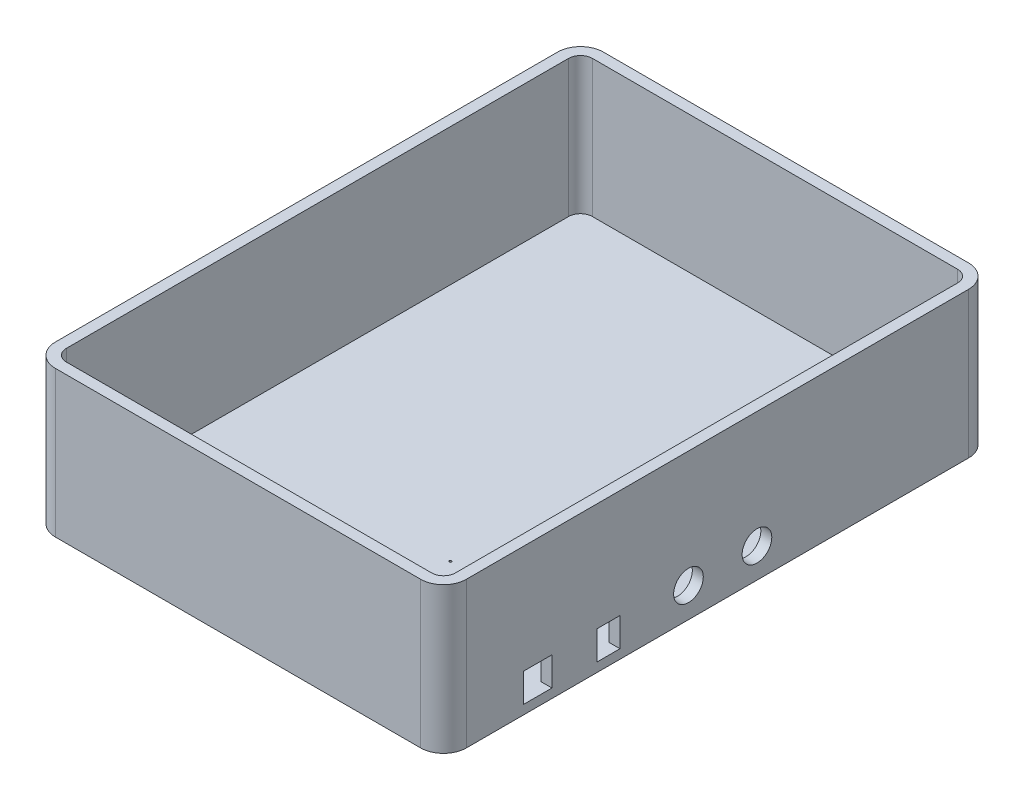
ISO-10303-21;
HEADER;
FILE_DESCRIPTION(('STEP AP214'),'2;1');
FILE_NAME('part.step','',(''),(''),'','','');
FILE_SCHEMA(('AUTOMOTIVE_DESIGN { 1 0 10303 214 1 1 1 1 }'));
ENDSEC;
DATA;
#1=APPLICATION_CONTEXT('core data for automotive mechanical design processes');
#2=APPLICATION_PROTOCOL_DEFINITION('international standard','automotive_design',2000,#1);
#3=PRODUCT_CONTEXT('',#1,'mechanical');
#4=PRODUCT('Part','Part','',(#3));
#5=PRODUCT_RELATED_PRODUCT_CATEGORY('part','',(#4));
#6=PRODUCT_DEFINITION_FORMATION('','',#4);
#7=PRODUCT_DEFINITION_CONTEXT('part definition',#1,'design');
#8=PRODUCT_DEFINITION('design','',#6,#7);
#9=PRODUCT_DEFINITION_SHAPE('','',#8);
#10=(LENGTH_UNIT() NAMED_UNIT(*) SI_UNIT(.MILLI.,.METRE.));
#11=(NAMED_UNIT(*) PLANE_ANGLE_UNIT() SI_UNIT($,.RADIAN.));
#12=(NAMED_UNIT(*) SI_UNIT($,.STERADIAN.) SOLID_ANGLE_UNIT());
#13=UNCERTAINTY_MEASURE_WITH_UNIT(LENGTH_MEASURE(1.E-05),#10,'distance_accuracy_value','');
#14=(GEOMETRIC_REPRESENTATION_CONTEXT(3) GLOBAL_UNCERTAINTY_ASSIGNED_CONTEXT((#13)) GLOBAL_UNIT_ASSIGNED_CONTEXT((#10,
#11,#12)) REPRESENTATION_CONTEXT('',''));
#15=CARTESIAN_POINT('',(0.,0.,0.));
#16=DIRECTION('',(0.,0.,1.));
#17=DIRECTION('',(1.,0.,0.));
#18=AXIS2_PLACEMENT_3D('',#15,#16,#17);
#19=CARTESIAN_POINT('',(180.,4.,0.));
#20=DIRECTION('',(-1.,0.,0.));
#21=DIRECTION('',(0.,0.,1.));
#22=AXIS2_PLACEMENT_3D('',#19,#20,#21);
#23=PLANE('',#22);
#24=CARTESIAN_POINT('',(180.,13.,-107.29));
#25=DIRECTION('',(1.,0.,0.));
#26=DIRECTION('',(0.,0.,-1.));
#27=AXIS2_PLACEMENT_3D('',#24,#25,#26);
#28=CIRCLE('',#27,6.5);
#29=CARTESIAN_POINT('',(180.,13.,-113.79));
#30=VERTEX_POINT('',#29);
#31=EDGE_CURVE('E466',#30,#30,#28,.T.);
#32=ORIENTED_EDGE('',*,*,#31,.F.);
#33=EDGE_LOOP('',(#32));
#34=FACE_BOUND('',#33,.T.);
#35=CARTESIAN_POINT('',(180.,13.,-137.29));
#36=DIRECTION('',(1.,0.,0.));
#37=DIRECTION('',(0.,0.,-1.));
#38=AXIS2_PLACEMENT_3D('',#35,#36,#37);
#39=CIRCLE('',#38,6.49999999999999);
#40=CARTESIAN_POINT('',(180.,13.,-143.79));
#41=VERTEX_POINT('',#40);
#42=EDGE_CURVE('E473',#41,#41,#39,.T.);
#43=ORIENTED_EDGE('',*,*,#42,.F.);
#44=EDGE_LOOP('',(#43));
#45=FACE_BOUND('',#44,.T.);
#46=DIRECTION('',(0.,0.,1.));
#47=VECTOR('',#46,1.);
#48=CARTESIAN_POINT('',(180.,16.6,0.));
#49=LINE('',#48,#47);
#50=CARTESIAN_POINT('',(180.,16.6,-47.5));
#51=VERTEX_POINT('',#50);
#52=CARTESIAN_POINT('',(180.,16.6,-35.));
#53=VERTEX_POINT('',#52);
#54=EDGE_CURVE('E214',#51,#53,#49,.T.);
#55=ORIENTED_EDGE('',*,*,#54,.F.);
#56=DIRECTION('',(0.,1.,0.));
#57=VECTOR('',#56,1.);
#58=CARTESIAN_POINT('',(180.,4.,-47.5));
#59=LINE('',#58,#57);
#60=CARTESIAN_POINT('',(180.,4.,-47.5));
#61=VERTEX_POINT('',#60);
#62=EDGE_CURVE('E220',#61,#51,#59,.T.);
#63=ORIENTED_EDGE('',*,*,#62,.F.);
#64=DIRECTION('',(0.,0.,1.));
#65=VECTOR('',#64,1.);
#66=CARTESIAN_POINT('',(180.,4.,0.));
#67=LINE('',#66,#65);
#68=CARTESIAN_POINT('',(180.,4.,-35.));
#69=VERTEX_POINT('',#68);
#70=EDGE_CURVE('E204',#61,#69,#67,.T.);
#71=ORIENTED_EDGE('',*,*,#70,.T.);
#72=DIRECTION('',(0.,-1.,0.));
#73=VECTOR('',#72,1.);
#74=CARTESIAN_POINT('',(180.,4.,-35.));
#75=LINE('',#74,#73);
#76=EDGE_CURVE('E236',#53,#69,#75,.T.);
#77=ORIENTED_EDGE('',*,*,#76,.F.);
#78=EDGE_LOOP('',(#55,#63,#71,#77));
#79=FACE_BOUND('',#78,.T.);
#80=DIRECTION('',(0.,0.,-1.));
#81=VECTOR('',#80,1.);
#82=CARTESIAN_POINT('',(180.,0.,0.));
#83=LINE('',#82,#81);
#84=CARTESIAN_POINT('',(180.,0.,-10.));
#85=VERTEX_POINT('',#84);
#86=CARTESIAN_POINT('',(180.,0.,-230.));
#87=VERTEX_POINT('',#86);
#88=EDGE_CURVE('E403',#85,#87,#83,.T.);
#89=ORIENTED_EDGE('',*,*,#88,.T.);
#90=DIRECTION('',(0.,-1.,0.));
#91=VECTOR('',#90,1.);
#92=CARTESIAN_POINT('',(180.,4.,-230.));
#93=LINE('',#92,#91);
#94=CARTESIAN_POINT('',(180.,64.,-230.));
#95=VERTEX_POINT('',#94);
#96=EDGE_CURVE('E441',#87,#95,#93,.F.);
#97=ORIENTED_EDGE('',*,*,#96,.T.);
#98=DIRECTION('',(0.,0.,-1.));
#99=VECTOR('',#98,1.);
#100=CARTESIAN_POINT('',(180.,64.,-10.));
#101=LINE('',#100,#99);
#102=CARTESIAN_POINT('',(180.,64.,-10.));
#103=VERTEX_POINT('',#102);
#104=EDGE_CURVE('E391',#103,#95,#101,.T.);
#105=ORIENTED_EDGE('',*,*,#104,.F.);
#106=DIRECTION('',(0.,-1.,0.));
#107=VECTOR('',#106,1.);
#108=CARTESIAN_POINT('',(180.,4.,-10.));
#109=LINE('',#108,#107);
#110=EDGE_CURVE('E437',#103,#85,#109,.T.);
#111=ORIENTED_EDGE('',*,*,#110,.T.);
#112=EDGE_LOOP('',(#89,#97,#105,#111));
#113=FACE_BOUND('',#112,.T.);
#114=DIRECTION('',(0.,0.,1.));
#115=VECTOR('',#114,1.);
#116=CARTESIAN_POINT('',(180.,16.6,0.));
#117=LINE('',#116,#115);
#118=CARTESIAN_POINT('',(180.,16.6,-77.29));
#119=VERTEX_POINT('',#118);
#120=CARTESIAN_POINT('',(180.,16.6,-67.29));
#121=VERTEX_POINT('',#120);
#122=EDGE_CURVE('E262',#119,#121,#117,.T.);
#123=ORIENTED_EDGE('',*,*,#122,.F.);
#124=DIRECTION('',(0.,1.,0.));
#125=VECTOR('',#124,1.);
#126=CARTESIAN_POINT('',(180.,4.,-77.29));
#127=LINE('',#126,#125);
#128=CARTESIAN_POINT('',(180.,4.,-77.29));
#129=VERTEX_POINT('',#128);
#130=EDGE_CURVE('E247',#129,#119,#127,.T.);
#131=ORIENTED_EDGE('',*,*,#130,.F.);
#132=DIRECTION('',(0.,0.,1.));
#133=VECTOR('',#132,1.);
#134=CARTESIAN_POINT('',(180.,4.,0.));
#135=LINE('',#134,#133);
#136=CARTESIAN_POINT('',(180.,4.,-67.29));
#137=VERTEX_POINT('',#136);
#138=EDGE_CURVE('E258',#129,#137,#135,.T.);
#139=ORIENTED_EDGE('',*,*,#138,.T.);
#140=DIRECTION('',(0.,-1.,0.));
#141=VECTOR('',#140,1.);
#142=CARTESIAN_POINT('',(180.,4.,-67.29));
#143=LINE('',#142,#141);
#144=EDGE_CURVE('E215',#121,#137,#143,.T.);
#145=ORIENTED_EDGE('',*,*,#144,.F.);
#146=EDGE_LOOP('',(#123,#131,#139,#145));
#147=FACE_BOUND('',#146,.T.);
#148=ADVANCED_FACE('F43',(#34,#45,#79,#113,#147),#23,.F.);
#149=CARTESIAN_POINT('',(175.2,64.,-10.));
#150=DIRECTION('',(-1.,0.,0.));
#151=DIRECTION('',(0.,0.,1.));
#152=AXIS2_PLACEMENT_3D('',#149,#150,#151);
#153=PLANE('',#152);
#154=CARTESIAN_POINT('',(175.2,13.,-107.29));
#155=DIRECTION('',(-1.,0.,0.));
#156=DIRECTION('',(0.,0.,1.));
#157=AXIS2_PLACEMENT_3D('',#154,#155,#156);
#158=CIRCLE('',#157,6.5);
#159=CARTESIAN_POINT('',(175.2,13.,-100.79));
#160=VERTEX_POINT('',#159);
#161=EDGE_CURVE('E47',#160,#160,#158,.T.);
#162=ORIENTED_EDGE('',*,*,#161,.F.);
#163=EDGE_LOOP('',(#162));
#164=FACE_BOUND('',#163,.T.);
#165=CARTESIAN_POINT('',(175.2,13.,-137.29));
#166=DIRECTION('',(-1.,0.,0.));
#167=DIRECTION('',(0.,0.,1.));
#168=AXIS2_PLACEMENT_3D('',#165,#166,#167);
#169=CIRCLE('',#168,6.49999999999999);
#170=CARTESIAN_POINT('',(175.2,13.,-130.79));
#171=VERTEX_POINT('',#170);
#172=EDGE_CURVE('E463',#171,#171,#169,.T.);
#173=ORIENTED_EDGE('',*,*,#172,.F.);
#174=EDGE_LOOP('',(#173));
#175=FACE_BOUND('',#174,.T.);
#176=DIRECTION('',(0.,0.,1.));
#177=VECTOR('',#176,1.);
#178=CARTESIAN_POINT('',(175.2,16.6,-10.));
#179=LINE('',#178,#177);
#180=CARTESIAN_POINT('',(175.2,16.6,-77.29));
#181=VERTEX_POINT('',#180);
#182=CARTESIAN_POINT('',(175.2,16.6,-67.29));
#183=VERTEX_POINT('',#182);
#184=EDGE_CURVE('E11',#181,#183,#179,.T.);
#185=ORIENTED_EDGE('',*,*,#184,.T.);
#186=DIRECTION('',(0.,-1.,0.));
#187=VECTOR('',#186,1.);
#188=CARTESIAN_POINT('',(175.2,64.,-67.29));
#189=LINE('',#188,#187);
#190=CARTESIAN_POINT('',(175.2,4.,-67.29));
#191=VERTEX_POINT('',#190);
#192=EDGE_CURVE('E250',#183,#191,#189,.T.);
#193=ORIENTED_EDGE('',*,*,#192,.T.);
#194=DIRECTION('',(0.,0.,-1.));
#195=VECTOR('',#194,1.);
#196=CARTESIAN_POINT('',(175.2,4.,-10.));
#197=LINE('',#196,#195);
#198=CARTESIAN_POINT('',(175.2,4.,-47.5));
#199=VERTEX_POINT('',#198);
#200=EDGE_CURVE('E337',#199,#191,#197,.T.);
#201=ORIENTED_EDGE('',*,*,#200,.F.);
#202=DIRECTION('',(0.,1.,0.));
#203=VECTOR('',#202,1.);
#204=CARTESIAN_POINT('',(175.2,64.,-47.5));
#205=LINE('',#204,#203);
#206=CARTESIAN_POINT('',(175.2,16.6,-47.5));
#207=VERTEX_POINT('',#206);
#208=EDGE_CURVE('E223',#199,#207,#205,.T.);
#209=ORIENTED_EDGE('',*,*,#208,.T.);
#210=DIRECTION('',(0.,0.,1.));
#211=VECTOR('',#210,1.);
#212=CARTESIAN_POINT('',(175.2,16.6,-10.));
#213=LINE('',#212,#211);
#214=CARTESIAN_POINT('',(175.2,16.6,-35.));
#215=VERTEX_POINT('',#214);
#216=EDGE_CURVE('E53',#207,#215,#213,.T.);
#217=ORIENTED_EDGE('',*,*,#216,.T.);
#218=DIRECTION('',(0.,-1.,0.));
#219=VECTOR('',#218,1.);
#220=CARTESIAN_POINT('',(175.2,64.,-35.));
#221=LINE('',#220,#219);
#222=CARTESIAN_POINT('',(175.2,4.,-35.));
#223=VERTEX_POINT('',#222);
#224=EDGE_CURVE('E231',#215,#223,#221,.T.);
#225=ORIENTED_EDGE('',*,*,#224,.T.);
#226=CARTESIAN_POINT('',(175.2,4.,-10.));
#227=VERTEX_POINT('',#226);
#228=EDGE_CURVE('E282',#227,#223,#197,.T.);
#229=ORIENTED_EDGE('',*,*,#228,.F.);
#230=DIRECTION('',(0.,-1.,0.));
#231=VECTOR('',#230,1.);
#232=CARTESIAN_POINT('',(175.2,64.,-10.));
#233=LINE('',#232,#231);
#234=CARTESIAN_POINT('',(175.2,64.,-10.));
#235=VERTEX_POINT('',#234);
#236=EDGE_CURVE('E341',#235,#227,#233,.T.);
#237=ORIENTED_EDGE('',*,*,#236,.F.);
#238=DIRECTION('',(0.,0.,-1.));
#239=VECTOR('',#238,1.);
#240=CARTESIAN_POINT('',(175.2,64.,-10.));
#241=LINE('',#240,#239);
#242=CARTESIAN_POINT('',(175.2,64.,-230.));
#243=VERTEX_POINT('',#242);
#244=EDGE_CURVE('E301',#235,#243,#241,.T.);
#245=ORIENTED_EDGE('',*,*,#244,.T.);
#246=DIRECTION('',(0.,-1.,0.));
#247=VECTOR('',#246,1.);
#248=CARTESIAN_POINT('',(175.2,64.,-230.));
#249=LINE('',#248,#247);
#250=CARTESIAN_POINT('',(175.2,4.,-230.));
#251=VERTEX_POINT('',#250);
#252=EDGE_CURVE('E304',#243,#251,#249,.T.);
#253=ORIENTED_EDGE('',*,*,#252,.T.);
#254=CARTESIAN_POINT('',(175.2,4.,-77.29));
#255=VERTEX_POINT('',#254);
#256=EDGE_CURVE('E334',#255,#251,#197,.T.);
#257=ORIENTED_EDGE('',*,*,#256,.F.);
#258=DIRECTION('',(0.,1.,0.));
#259=VECTOR('',#258,1.);
#260=CARTESIAN_POINT('',(175.2,64.,-77.29));
#261=LINE('',#260,#259);
#262=EDGE_CURVE('E243',#255,#181,#261,.T.);
#263=ORIENTED_EDGE('',*,*,#262,.T.);
#264=EDGE_LOOP('',(#185,#193,#201,#209,#217,#225,#229,#237,#245,#253,#257,#263));
#265=FACE_BOUND('',#264,.T.);
#266=ADVANCED_FACE('F502',(#164,#175,#265),#153,.T.);
#267=CARTESIAN_POINT('',(0.,4.,0.));
#268=DIRECTION('',(1.,0.,0.));
#269=DIRECTION('',(0.,0.,-1.));
#270=AXIS2_PLACEMENT_3D('',#267,#268,#269);
#271=PLANE('',#270);
#272=DIRECTION('',(0.,-1.,0.));
#273=VECTOR('',#272,1.);
#274=CARTESIAN_POINT('',(0.,4.,-10.));
#275=LINE('',#274,#273);
#276=CARTESIAN_POINT('',(0.,0.,-10.));
#277=VERTEX_POINT('',#276);
#278=CARTESIAN_POINT('',(0.,64.,-10.));
#279=VERTEX_POINT('',#278);
#280=EDGE_CURVE('E411',#277,#279,#275,.F.);
#281=ORIENTED_EDGE('',*,*,#280,.T.);
#282=DIRECTION('',(0.,0.,1.));
#283=VECTOR('',#282,1.);
#284=CARTESIAN_POINT('',(0.,64.,-230.));
#285=LINE('',#284,#283);
#286=CARTESIAN_POINT('',(0.,64.,-230.));
#287=VERTEX_POINT('',#286);
#288=EDGE_CURVE('E375',#287,#279,#285,.T.);
#289=ORIENTED_EDGE('',*,*,#288,.F.);
#290=DIRECTION('',(0.,-1.,0.));
#291=VECTOR('',#290,1.);
#292=CARTESIAN_POINT('',(0.,4.,-230.));
#293=LINE('',#292,#291);
#294=CARTESIAN_POINT('',(0.,0.,-230.));
#295=VERTEX_POINT('',#294);
#296=EDGE_CURVE('E414',#287,#295,#293,.T.);
#297=ORIENTED_EDGE('',*,*,#296,.T.);
#298=DIRECTION('',(0.,0.,1.));
#299=VECTOR('',#298,1.);
#300=CARTESIAN_POINT('',(0.,0.,0.));
#301=LINE('',#300,#299);
#302=EDGE_CURVE('E395',#295,#277,#301,.T.);
#303=ORIENTED_EDGE('',*,*,#302,.T.);
#304=EDGE_LOOP('',(#281,#289,#297,#303));
#305=FACE_BOUND('',#304,.T.);
#306=ADVANCED_FACE('F569',(#305),#271,.F.);
#307=CARTESIAN_POINT('',(0.,4.,0.));
#308=DIRECTION('',(0.,0.,-1.));
#309=DIRECTION('',(-1.,0.,0.));
#310=AXIS2_PLACEMENT_3D('',#307,#308,#309);
#311=PLANE('',#310);
#312=DIRECTION('',(0.,-1.,0.));
#313=VECTOR('',#312,1.);
#314=CARTESIAN_POINT('',(170.,4.,0.));
#315=LINE('',#314,#313);
#316=CARTESIAN_POINT('',(170.,0.,0.));
#317=VERTEX_POINT('',#316);
#318=CARTESIAN_POINT('',(170.,64.,0.));
#319=VERTEX_POINT('',#318);
#320=EDGE_CURVE('E444',#317,#319,#315,.F.);
#321=ORIENTED_EDGE('',*,*,#320,.T.);
#322=DIRECTION('',(1.,0.,0.));
#323=VECTOR('',#322,1.);
#324=CARTESIAN_POINT('',(10.,64.,0.));
#325=LINE('',#324,#323);
#326=CARTESIAN_POINT('',(10.,64.,0.));
#327=VERTEX_POINT('',#326);
#328=EDGE_CURVE('E383',#327,#319,#325,.T.);
#329=ORIENTED_EDGE('',*,*,#328,.F.);
#330=DIRECTION('',(0.,-1.,0.));
#331=VECTOR('',#330,1.);
#332=CARTESIAN_POINT('',(10.,4.,0.));
#333=LINE('',#332,#331);
#334=CARTESIAN_POINT('',(10.,0.,0.));
#335=VERTEX_POINT('',#334);
#336=EDGE_CURVE('E447',#327,#335,#333,.T.);
#337=ORIENTED_EDGE('',*,*,#336,.T.);
#338=DIRECTION('',(1.,0.,0.));
#339=VECTOR('',#338,1.);
#340=CARTESIAN_POINT('',(0.,0.,0.));
#341=LINE('',#340,#339);
#342=EDGE_CURVE('E399',#335,#317,#341,.T.);
#343=ORIENTED_EDGE('',*,*,#342,.T.);
#344=EDGE_LOOP('',(#321,#329,#337,#343));
#345=FACE_BOUND('',#344,.T.);
#346=ADVANCED_FACE('F577',(#345),#311,.F.);
#347=CARTESIAN_POINT('',(0.,4.,-240.));
#348=DIRECTION('',(0.,0.,1.));
#349=DIRECTION('',(1.,0.,0.));
#350=AXIS2_PLACEMENT_3D('',#347,#348,#349);
#351=PLANE('',#350);
#352=DIRECTION('',(-1.,0.,0.));
#353=VECTOR('',#352,1.);
#354=CARTESIAN_POINT('',(0.,0.,-240.));
#355=LINE('',#354,#353);
#356=CARTESIAN_POINT('',(170.,0.,-240.));
#357=VERTEX_POINT('',#356);
#358=CARTESIAN_POINT('',(10.,0.,-240.));
#359=VERTEX_POINT('',#358);
#360=EDGE_CURVE('E407',#357,#359,#355,.T.);
#361=ORIENTED_EDGE('',*,*,#360,.T.);
#362=DIRECTION('',(0.,-1.,0.));
#363=VECTOR('',#362,1.);
#364=CARTESIAN_POINT('',(10.,4.,-240.));
#365=LINE('',#364,#363);
#366=CARTESIAN_POINT('',(10.,64.,-240.));
#367=VERTEX_POINT('',#366);
#368=EDGE_CURVE('E434',#359,#367,#365,.F.);
#369=ORIENTED_EDGE('',*,*,#368,.T.);
#370=DIRECTION('',(-1.,0.,0.));
#371=VECTOR('',#370,1.);
#372=CARTESIAN_POINT('',(170.,64.,-240.));
#373=LINE('',#372,#371);
#374=CARTESIAN_POINT('',(170.,64.,-240.));
#375=VERTEX_POINT('',#374);
#376=EDGE_CURVE('E367',#375,#367,#373,.T.);
#377=ORIENTED_EDGE('',*,*,#376,.F.);
#378=DIRECTION('',(0.,-1.,0.));
#379=VECTOR('',#378,1.);
#380=CARTESIAN_POINT('',(170.,4.,-240.));
#381=LINE('',#380,#379);
#382=EDGE_CURVE('E430',#375,#357,#381,.T.);
#383=ORIENTED_EDGE('',*,*,#382,.T.);
#384=EDGE_LOOP('',(#361,#369,#377,#383));
#385=FACE_BOUND('',#384,.T.);
#386=ADVANCED_FACE('F575',(#385),#351,.F.);
#387=CARTESIAN_POINT('',(0.,0.,0.));
#388=DIRECTION('',(0.,-1.,0.));
#389=DIRECTION('',(0.,0.,-1.));
#390=AXIS2_PLACEMENT_3D('',#387,#388,#389);
#391=PLANE('',#390);
#392=CARTESIAN_POINT('',(159.96,0.,-29.8));
#393=DIRECTION('',(0.,1.,0.));
#394=DIRECTION('',(0.,0.,1.));
#395=AXIS2_PLACEMENT_3D('',#392,#393,#394);
#396=CIRCLE('',#395,0.499999999999999);
#397=CARTESIAN_POINT('',(159.96,0.,-29.3));
#398=VERTEX_POINT('',#397);
#399=EDGE_CURVE('E266',#398,#398,#396,.T.);
#400=ORIENTED_EDGE('',*,*,#399,.T.);
#401=EDGE_LOOP('',(#400));
#402=FACE_BOUND('',#401,.T.);
#403=CARTESIAN_POINT('',(109.7,0.,-45.3));
#404=DIRECTION('',(0.,1.,0.));
#405=DIRECTION('',(0.,0.,1.));
#406=AXIS2_PLACEMENT_3D('',#403,#404,#405);
#407=CIRCLE('',#406,0.499999999999999);
#408=CARTESIAN_POINT('',(109.7,0.,-44.8));
#409=VERTEX_POINT('',#408);
#410=EDGE_CURVE('E271',#409,#409,#407,.T.);
#411=ORIENTED_EDGE('',*,*,#410,.T.);
#412=EDGE_LOOP('',(#411));
#413=FACE_BOUND('',#412,.T.);
#414=CARTESIAN_POINT('',(109.7,0.,-73.3));
#415=DIRECTION('',(0.,1.,0.));
#416=DIRECTION('',(0.,0.,1.));
#417=AXIS2_PLACEMENT_3D('',#414,#415,#416);
#418=CIRCLE('',#417,0.499999999999999);
#419=CARTESIAN_POINT('',(109.7,0.,-72.8));
#420=VERTEX_POINT('',#419);
#421=EDGE_CURVE('E265',#420,#420,#418,.T.);
#422=ORIENTED_EDGE('',*,*,#421,.T.);
#423=EDGE_LOOP('',(#422));
#424=FACE_BOUND('',#423,.T.);
#425=ORIENTED_EDGE('',*,*,#302,.F.);
#426=CARTESIAN_POINT('',(10.,0.,-230.));
#427=DIRECTION('',(0.,-1.,0.));
#428=DIRECTION('',(0.,0.,-1.));
#429=AXIS2_PLACEMENT_3D('',#426,#427,#428);
#430=CIRCLE('',#429,10.);
#431=EDGE_CURVE('E427',#295,#359,#430,.T.);
#432=ORIENTED_EDGE('',*,*,#431,.T.);
#433=ORIENTED_EDGE('',*,*,#360,.F.);
#434=CARTESIAN_POINT('',(170.,0.,-230.));
#435=DIRECTION('',(0.,-1.,0.));
#436=DIRECTION('',(0.,0.,-1.));
#437=AXIS2_PLACEMENT_3D('',#434,#435,#436);
#438=CIRCLE('',#437,10.);
#439=EDGE_CURVE('E424',#357,#87,#438,.T.);
#440=ORIENTED_EDGE('',*,*,#439,.T.);
#441=ORIENTED_EDGE('',*,*,#88,.F.);
#442=CARTESIAN_POINT('',(170.,0.,-10.));
#443=DIRECTION('',(0.,-1.,0.));
#444=DIRECTION('',(0.,0.,-1.));
#445=AXIS2_PLACEMENT_3D('',#442,#443,#444);
#446=CIRCLE('',#445,10.);
#447=EDGE_CURVE('E418',#85,#317,#446,.T.);
#448=ORIENTED_EDGE('',*,*,#447,.T.);
#449=ORIENTED_EDGE('',*,*,#342,.F.);
#450=CARTESIAN_POINT('',(10.,0.,-10.));
#451=DIRECTION('',(0.,-1.,0.));
#452=DIRECTION('',(0.,0.,-1.));
#453=AXIS2_PLACEMENT_3D('',#450,#451,#452);
#454=CIRCLE('',#453,10.);
#455=EDGE_CURVE('E421',#335,#277,#454,.T.);
#456=ORIENTED_EDGE('',*,*,#455,.T.);
#457=EDGE_LOOP('',(#425,#432,#433,#440,#441,#448,#449,#456));
#458=FACE_BOUND('',#457,.T.);
#459=ADVANCED_FACE('F588',(#402,#413,#424,#458),#391,.T.);
#460=CARTESIAN_POINT('',(10.,4.,-230.));
#461=DIRECTION('',(0.,-1.,0.));
#462=DIRECTION('',(0.,0.,-1.));
#463=AXIS2_PLACEMENT_3D('',#460,#461,#462);
#464=CYLINDRICAL_SURFACE('',#463,10.);
#465=ORIENTED_EDGE('',*,*,#296,.F.);
#466=CARTESIAN_POINT('',(10.,64.,-230.));
#467=DIRECTION('',(0.,1.,0.));
#468=DIRECTION('',(0.,0.,1.));
#469=AXIS2_PLACEMENT_3D('',#466,#467,#468);
#470=CIRCLE('',#469,10.);
#471=EDGE_CURVE('E371',#367,#287,#470,.T.);
#472=ORIENTED_EDGE('',*,*,#471,.F.);
#473=ORIENTED_EDGE('',*,*,#368,.F.);
#474=ORIENTED_EDGE('',*,*,#431,.F.);
#475=EDGE_LOOP('',(#465,#472,#473,#474));
#476=FACE_BOUND('',#475,.T.);
#477=ADVANCED_FACE('F584',(#476),#464,.T.);
#478=CARTESIAN_POINT('',(170.,4.,-230.));
#479=DIRECTION('',(0.,-1.,0.));
#480=DIRECTION('',(0.,0.,-1.));
#481=AXIS2_PLACEMENT_3D('',#478,#479,#480);
#482=CYLINDRICAL_SURFACE('',#481,10.);
#483=ORIENTED_EDGE('',*,*,#382,.F.);
#484=CARTESIAN_POINT('',(170.,64.,-230.));
#485=DIRECTION('',(0.,1.,0.));
#486=DIRECTION('',(0.,0.,1.));
#487=AXIS2_PLACEMENT_3D('',#484,#485,#486);
#488=CIRCLE('',#487,10.);
#489=EDGE_CURVE('E363',#95,#375,#488,.T.);
#490=ORIENTED_EDGE('',*,*,#489,.F.);
#491=ORIENTED_EDGE('',*,*,#96,.F.);
#492=ORIENTED_EDGE('',*,*,#439,.F.);
#493=EDGE_LOOP('',(#483,#490,#491,#492));
#494=FACE_BOUND('',#493,.T.);
#495=ADVANCED_FACE('F587',(#494),#482,.T.);
#496=CARTESIAN_POINT('',(10.,4.,-10.));
#497=DIRECTION('',(0.,-1.,0.));
#498=DIRECTION('',(0.,0.,-1.));
#499=AXIS2_PLACEMENT_3D('',#496,#497,#498);
#500=CYLINDRICAL_SURFACE('',#499,10.);
#501=ORIENTED_EDGE('',*,*,#336,.F.);
#502=CARTESIAN_POINT('',(10.,64.,-10.));
#503=DIRECTION('',(0.,1.,0.));
#504=DIRECTION('',(0.,0.,1.));
#505=AXIS2_PLACEMENT_3D('',#502,#503,#504);
#506=CIRCLE('',#505,10.);
#507=EDGE_CURVE('E379',#279,#327,#506,.T.);
#508=ORIENTED_EDGE('',*,*,#507,.F.);
#509=ORIENTED_EDGE('',*,*,#280,.F.);
#510=ORIENTED_EDGE('',*,*,#455,.F.);
#511=EDGE_LOOP('',(#501,#508,#509,#510));
#512=FACE_BOUND('',#511,.T.);
#513=ADVANCED_FACE('F591',(#512),#500,.T.);
#514=CARTESIAN_POINT('',(170.,4.,-10.));
#515=DIRECTION('',(0.,-1.,0.));
#516=DIRECTION('',(0.,0.,-1.));
#517=AXIS2_PLACEMENT_3D('',#514,#515,#516);
#518=CYLINDRICAL_SURFACE('',#517,10.);
#519=ORIENTED_EDGE('',*,*,#110,.F.);
#520=CARTESIAN_POINT('',(170.,64.,-10.));
#521=DIRECTION('',(0.,1.,0.));
#522=DIRECTION('',(0.,0.,1.));
#523=AXIS2_PLACEMENT_3D('',#520,#521,#522);
#524=CIRCLE('',#523,10.);
#525=EDGE_CURVE('E387',#319,#103,#524,.T.);
#526=ORIENTED_EDGE('',*,*,#525,.F.);
#527=ORIENTED_EDGE('',*,*,#320,.F.);
#528=ORIENTED_EDGE('',*,*,#447,.F.);
#529=EDGE_LOOP('',(#519,#526,#527,#528));
#530=FACE_BOUND('',#529,.T.);
#531=ADVANCED_FACE('F45',(#530),#518,.T.);
#532=CARTESIAN_POINT('',(170.,64.,-230.));
#533=DIRECTION('',(0.,1.,0.));
#534=DIRECTION('',(0.,0.,1.));
#535=AXIS2_PLACEMENT_3D('',#532,#533,#534);
#536=PLANE('',#535);
#537=ORIENTED_EDGE('',*,*,#489,.T.);
#538=ORIENTED_EDGE('',*,*,#376,.T.);
#539=ORIENTED_EDGE('',*,*,#471,.T.);
#540=ORIENTED_EDGE('',*,*,#288,.T.);
#541=ORIENTED_EDGE('',*,*,#507,.T.);
#542=ORIENTED_EDGE('',*,*,#328,.T.);
#543=ORIENTED_EDGE('',*,*,#525,.T.);
#544=ORIENTED_EDGE('',*,*,#104,.T.);
#545=EDGE_LOOP('',(#537,#538,#539,#540,#541,#542,#543,#544));
#546=FACE_BOUND('',#545,.T.);
#547=DIRECTION('',(-1.,0.,0.));
#548=VECTOR('',#547,1.);
#549=CARTESIAN_POINT('',(170.,64.,-235.2));
#550=LINE('',#549,#548);
#551=CARTESIAN_POINT('',(170.,64.,-235.2));
#552=VERTEX_POINT('',#551);
#553=CARTESIAN_POINT('',(10.,64.,-235.2));
#554=VERTEX_POINT('',#553);
#555=EDGE_CURVE('E281',#552,#554,#550,.T.);
#556=ORIENTED_EDGE('',*,*,#555,.F.);
#557=CARTESIAN_POINT('',(170.,64.,-230.));
#558=DIRECTION('',(0.,1.,0.));
#559=DIRECTION('',(0.,0.,1.));
#560=AXIS2_PLACEMENT_3D('',#557,#558,#559);
#561=CIRCLE('',#560,5.20000000000001);
#562=EDGE_CURVE('E278',#243,#552,#561,.T.);
#563=ORIENTED_EDGE('',*,*,#562,.F.);
#564=ORIENTED_EDGE('',*,*,#244,.F.);
#565=CARTESIAN_POINT('',(170.,64.,-10.));
#566=DIRECTION('',(0.,1.,0.));
#567=DIRECTION('',(0.,0.,1.));
#568=AXIS2_PLACEMENT_3D('',#565,#566,#567);
#569=CIRCLE('',#568,5.2);
#570=CARTESIAN_POINT('',(170.,64.,-4.80000000000001));
#571=VERTEX_POINT('',#570);
#572=EDGE_CURVE('E297',#571,#235,#569,.T.);
#573=ORIENTED_EDGE('',*,*,#572,.F.);
#574=DIRECTION('',(1.,0.,0.));
#575=VECTOR('',#574,1.);
#576=CARTESIAN_POINT('',(10.,64.,-4.8));
#577=LINE('',#576,#575);
#578=CARTESIAN_POINT('',(10.,64.,-4.80000000000001));
#579=VERTEX_POINT('',#578);
#580=EDGE_CURVE('E294',#579,#571,#577,.T.);
#581=ORIENTED_EDGE('',*,*,#580,.F.);
#582=CARTESIAN_POINT('',(10.,64.,-10.));
#583=DIRECTION('',(0.,1.,0.));
#584=DIRECTION('',(0.,0.,1.));
#585=AXIS2_PLACEMENT_3D('',#582,#583,#584);
#586=CIRCLE('',#585,5.19999999999999);
#587=CARTESIAN_POINT('',(4.80000000000003,64.,-10.));
#588=VERTEX_POINT('',#587);
#589=EDGE_CURVE('E291',#588,#579,#586,.T.);
#590=ORIENTED_EDGE('',*,*,#589,.F.);
#591=DIRECTION('',(0.,0.,1.));
#592=VECTOR('',#591,1.);
#593=CARTESIAN_POINT('',(4.79999999999999,64.,-230.));
#594=LINE('',#593,#592);
#595=CARTESIAN_POINT('',(4.80000000000001,64.,-230.));
#596=VERTEX_POINT('',#595);
#597=EDGE_CURVE('E288',#596,#588,#594,.T.);
#598=ORIENTED_EDGE('',*,*,#597,.F.);
#599=CARTESIAN_POINT('',(10.,64.,-230.));
#600=DIRECTION('',(0.,1.,0.));
#601=DIRECTION('',(0.,0.,1.));
#602=AXIS2_PLACEMENT_3D('',#599,#600,#601);
#603=CIRCLE('',#602,5.19999999999999);
#604=EDGE_CURVE('E285',#554,#596,#603,.T.);
#605=ORIENTED_EDGE('',*,*,#604,.F.);
#606=EDGE_LOOP('',(#556,#563,#564,#573,#581,#590,#598,#605));
#607=FACE_BOUND('',#606,.T.);
#608=ADVANCED_FACE('F521',(#546,#607),#536,.T.);
#609=CARTESIAN_POINT('',(170.,64.,-230.));
#610=DIRECTION('',(0.,-1.,0.));
#611=DIRECTION('',(0.,0.,-1.));
#612=AXIS2_PLACEMENT_3D('',#609,#610,#611);
#613=CYLINDRICAL_SURFACE('',#612,5.20000000000001);
#614=CARTESIAN_POINT('',(170.,4.,-230.));
#615=DIRECTION('',(0.,1.,0.));
#616=DIRECTION('',(0.,0.,1.));
#617=AXIS2_PLACEMENT_3D('',#614,#615,#616);
#618=CIRCLE('',#617,5.20000000000001);
#619=CARTESIAN_POINT('',(170.,4.,-235.2));
#620=VERTEX_POINT('',#619);
#621=EDGE_CURVE('E305',#251,#620,#618,.T.);
#622=ORIENTED_EDGE('',*,*,#621,.F.);
#623=ORIENTED_EDGE('',*,*,#252,.F.);
#624=ORIENTED_EDGE('',*,*,#562,.T.);
#625=DIRECTION('',(0.,-1.,0.));
#626=VECTOR('',#625,1.);
#627=CARTESIAN_POINT('',(170.,64.,-235.2));
#628=LINE('',#627,#626);
#629=EDGE_CURVE('E359',#552,#620,#628,.T.);
#630=ORIENTED_EDGE('',*,*,#629,.T.);
#631=EDGE_LOOP('',(#622,#623,#624,#630));
#632=FACE_BOUND('',#631,.T.);
#633=ADVANCED_FACE('F513',(#632),#613,.F.);
#634=CARTESIAN_POINT('',(170.,64.,-235.2));
#635=DIRECTION('',(0.,0.,1.));
#636=DIRECTION('',(1.,0.,0.));
#637=AXIS2_PLACEMENT_3D('',#634,#635,#636);
#638=PLANE('',#637);
#639=DIRECTION('',(-1.,0.,0.));
#640=VECTOR('',#639,1.);
#641=CARTESIAN_POINT('',(170.,4.,-235.2));
#642=LINE('',#641,#640);
#643=CARTESIAN_POINT('',(10.,4.,-235.2));
#644=VERTEX_POINT('',#643);
#645=EDGE_CURVE('E309',#620,#644,#642,.T.);
#646=ORIENTED_EDGE('',*,*,#645,.F.);
#647=ORIENTED_EDGE('',*,*,#629,.F.);
#648=ORIENTED_EDGE('',*,*,#555,.T.);
#649=DIRECTION('',(0.,-1.,0.));
#650=VECTOR('',#649,1.);
#651=CARTESIAN_POINT('',(10.,64.,-235.2));
#652=LINE('',#651,#650);
#653=EDGE_CURVE('E356',#554,#644,#652,.T.);
#654=ORIENTED_EDGE('',*,*,#653,.T.);
#655=EDGE_LOOP('',(#646,#647,#648,#654));
#656=FACE_BOUND('',#655,.T.);
#657=ADVANCED_FACE('F517',(#656),#638,.T.);
#658=CARTESIAN_POINT('',(10.,64.,-230.));
#659=DIRECTION('',(0.,-1.,0.));
#660=DIRECTION('',(0.,0.,-1.));
#661=AXIS2_PLACEMENT_3D('',#658,#659,#660);
#662=CYLINDRICAL_SURFACE('',#661,5.19999999999999);
#663=CARTESIAN_POINT('',(10.,4.,-230.));
#664=DIRECTION('',(0.,1.,0.));
#665=DIRECTION('',(0.,0.,1.));
#666=AXIS2_PLACEMENT_3D('',#663,#664,#665);
#667=CIRCLE('',#666,5.19999999999999);
#668=CARTESIAN_POINT('',(4.80000000000001,4.,-230.));
#669=VERTEX_POINT('',#668);
#670=EDGE_CURVE('E314',#644,#669,#667,.T.);
#671=ORIENTED_EDGE('',*,*,#670,.F.);
#672=ORIENTED_EDGE('',*,*,#653,.F.);
#673=ORIENTED_EDGE('',*,*,#604,.T.);
#674=DIRECTION('',(0.,-1.,0.));
#675=VECTOR('',#674,1.);
#676=CARTESIAN_POINT('',(4.80000000000001,64.,-230.));
#677=LINE('',#676,#675);
#678=EDGE_CURVE('E353',#596,#669,#677,.T.);
#679=ORIENTED_EDGE('',*,*,#678,.T.);
#680=EDGE_LOOP('',(#671,#672,#673,#679));
#681=FACE_BOUND('',#680,.T.);
#682=ADVANCED_FACE('F527',(#681),#662,.F.);
#683=CARTESIAN_POINT('',(4.79999999999999,64.,-230.));
#684=DIRECTION('',(1.,0.,0.));
#685=DIRECTION('',(0.,0.,-1.));
#686=AXIS2_PLACEMENT_3D('',#683,#684,#685);
#687=PLANE('',#686);
#688=DIRECTION('',(0.,0.,1.));
#689=VECTOR('',#688,1.);
#690=CARTESIAN_POINT('',(4.79999999999999,4.,-230.));
#691=LINE('',#690,#689);
#692=CARTESIAN_POINT('',(4.80000000000003,4.,-10.));
#693=VERTEX_POINT('',#692);
#694=EDGE_CURVE('E318',#669,#693,#691,.T.);
#695=ORIENTED_EDGE('',*,*,#694,.F.);
#696=ORIENTED_EDGE('',*,*,#678,.F.);
#697=ORIENTED_EDGE('',*,*,#597,.T.);
#698=DIRECTION('',(0.,-1.,0.));
#699=VECTOR('',#698,1.);
#700=CARTESIAN_POINT('',(4.80000000000003,64.,-10.));
#701=LINE('',#700,#699);
#702=EDGE_CURVE('E350',#588,#693,#701,.T.);
#703=ORIENTED_EDGE('',*,*,#702,.T.);
#704=EDGE_LOOP('',(#695,#696,#697,#703));
#705=FACE_BOUND('',#704,.T.);
#706=ADVANCED_FACE('F530',(#705),#687,.T.);
#707=CARTESIAN_POINT('',(10.,64.,-10.));
#708=DIRECTION('',(0.,-1.,0.));
#709=DIRECTION('',(0.,0.,-1.));
#710=AXIS2_PLACEMENT_3D('',#707,#708,#709);
#711=CYLINDRICAL_SURFACE('',#710,5.19999999999999);
#712=CARTESIAN_POINT('',(10.,4.,-10.));
#713=DIRECTION('',(0.,1.,0.));
#714=DIRECTION('',(0.,0.,1.));
#715=AXIS2_PLACEMENT_3D('',#712,#713,#714);
#716=CIRCLE('',#715,5.19999999999999);
#717=CARTESIAN_POINT('',(10.,4.,-4.80000000000001));
#718=VERTEX_POINT('',#717);
#719=EDGE_CURVE('E322',#693,#718,#716,.T.);
#720=ORIENTED_EDGE('',*,*,#719,.F.);
#721=ORIENTED_EDGE('',*,*,#702,.F.);
#722=ORIENTED_EDGE('',*,*,#589,.T.);
#723=DIRECTION('',(0.,-1.,0.));
#724=VECTOR('',#723,1.);
#725=CARTESIAN_POINT('',(10.,64.,-4.80000000000001));
#726=LINE('',#725,#724);
#727=EDGE_CURVE('E347',#579,#718,#726,.T.);
#728=ORIENTED_EDGE('',*,*,#727,.T.);
#729=EDGE_LOOP('',(#720,#721,#722,#728));
#730=FACE_BOUND('',#729,.T.);
#731=ADVANCED_FACE('F535',(#730),#711,.F.);
#732=CARTESIAN_POINT('',(10.,64.,-4.8));
#733=DIRECTION('',(0.,0.,-1.));
#734=DIRECTION('',(-1.,0.,0.));
#735=AXIS2_PLACEMENT_3D('',#732,#733,#734);
#736=PLANE('',#735);
#737=DIRECTION('',(1.,0.,0.));
#738=VECTOR('',#737,1.);
#739=CARTESIAN_POINT('',(10.,4.,-4.8));
#740=LINE('',#739,#738);
#741=CARTESIAN_POINT('',(170.,4.,-4.80000000000001));
#742=VERTEX_POINT('',#741);
#743=EDGE_CURVE('E326',#718,#742,#740,.T.);
#744=ORIENTED_EDGE('',*,*,#743,.F.);
#745=ORIENTED_EDGE('',*,*,#727,.F.);
#746=ORIENTED_EDGE('',*,*,#580,.T.);
#747=DIRECTION('',(0.,-1.,0.));
#748=VECTOR('',#747,1.);
#749=CARTESIAN_POINT('',(170.,64.,-4.80000000000001));
#750=LINE('',#749,#748);
#751=EDGE_CURVE('E344',#571,#742,#750,.T.);
#752=ORIENTED_EDGE('',*,*,#751,.T.);
#753=EDGE_LOOP('',(#744,#745,#746,#752));
#754=FACE_BOUND('',#753,.T.);
#755=ADVANCED_FACE('F539',(#754),#736,.T.);
#756=CARTESIAN_POINT('',(170.,64.,-10.));
#757=DIRECTION('',(0.,-1.,0.));
#758=DIRECTION('',(0.,0.,-1.));
#759=AXIS2_PLACEMENT_3D('',#756,#757,#758);
#760=CYLINDRICAL_SURFACE('',#759,5.2);
#761=CARTESIAN_POINT('',(170.,4.,-10.));
#762=DIRECTION('',(0.,1.,0.));
#763=DIRECTION('',(0.,0.,1.));
#764=AXIS2_PLACEMENT_3D('',#761,#762,#763);
#765=CIRCLE('',#764,5.2);
#766=EDGE_CURVE('E330',#742,#227,#765,.T.);
#767=ORIENTED_EDGE('',*,*,#766,.F.);
#768=ORIENTED_EDGE('',*,*,#751,.F.);
#769=ORIENTED_EDGE('',*,*,#572,.T.);
#770=ORIENTED_EDGE('',*,*,#236,.T.);
#771=EDGE_LOOP('',(#767,#768,#769,#770));
#772=FACE_BOUND('',#771,.T.);
#773=ADVANCED_FACE('F544',(#772),#760,.F.);
#774=CARTESIAN_POINT('',(0.,4.,0.));
#775=DIRECTION('',(0.,-1.,0.));
#776=DIRECTION('',(0.,0.,-1.));
#777=AXIS2_PLACEMENT_3D('',#774,#775,#776);
#778=PLANE('',#777);
#779=ORIENTED_EDGE('',*,*,#200,.T.);
#780=DIRECTION('',(1.,0.,0.));
#781=VECTOR('',#780,1.);
#782=CARTESIAN_POINT('',(185.2,4.,-67.29));
#783=LINE('',#782,#781);
#784=EDGE_CURVE('E61',#191,#137,#783,.T.);
#785=ORIENTED_EDGE('',*,*,#784,.T.);
#786=ORIENTED_EDGE('',*,*,#138,.F.);
#787=DIRECTION('',(-1.,0.,0.));
#788=VECTOR('',#787,1.);
#789=CARTESIAN_POINT('',(185.2,4.,-77.29));
#790=LINE('',#789,#788);
#791=EDGE_CURVE('E485',#129,#255,#790,.T.);
#792=ORIENTED_EDGE('',*,*,#791,.T.);
#793=ORIENTED_EDGE('',*,*,#256,.T.);
#794=ORIENTED_EDGE('',*,*,#621,.T.);
#795=ORIENTED_EDGE('',*,*,#645,.T.);
#796=ORIENTED_EDGE('',*,*,#670,.T.);
#797=ORIENTED_EDGE('',*,*,#694,.T.);
#798=ORIENTED_EDGE('',*,*,#719,.T.);
#799=ORIENTED_EDGE('',*,*,#743,.T.);
#800=ORIENTED_EDGE('',*,*,#766,.T.);
#801=ORIENTED_EDGE('',*,*,#228,.T.);
#802=DIRECTION('',(1.,0.,0.));
#803=VECTOR('',#802,1.);
#804=CARTESIAN_POINT('',(182.7,4.,-35.));
#805=LINE('',#804,#803);
#806=EDGE_CURVE('E68',#223,#69,#805,.T.);
#807=ORIENTED_EDGE('',*,*,#806,.T.);
#808=ORIENTED_EDGE('',*,*,#70,.F.);
#809=DIRECTION('',(-1.,0.,0.));
#810=VECTOR('',#809,1.);
#811=CARTESIAN_POINT('',(182.7,4.,-47.5));
#812=LINE('',#811,#810);
#813=EDGE_CURVE('E208',#61,#199,#812,.T.);
#814=ORIENTED_EDGE('',*,*,#813,.T.);
#815=EDGE_LOOP('',(#779,#785,#786,#792,#793,#794,#795,#796,#797,#798,#799,#800,#801,#807,#808,#814));
#816=FACE_BOUND('',#815,.T.);
#817=CARTESIAN_POINT('',(159.96,4.,-29.8));
#818=DIRECTION('',(0.,-1.,0.));
#819=DIRECTION('',(0.,0.,-1.));
#820=AXIS2_PLACEMENT_3D('',#817,#818,#819);
#821=CIRCLE('',#820,0.499999999999999);
#822=CARTESIAN_POINT('',(159.96,4.,-30.3));
#823=VERTEX_POINT('',#822);
#824=EDGE_CURVE('E310',#823,#823,#821,.T.);
#825=ORIENTED_EDGE('',*,*,#824,.T.);
#826=EDGE_LOOP('',(#825));
#827=FACE_BOUND('',#826,.T.);
#828=CARTESIAN_POINT('',(109.7,4.,-45.3));
#829=DIRECTION('',(0.,-1.,0.));
#830=DIRECTION('',(0.,0.,-1.));
#831=AXIS2_PLACEMENT_3D('',#828,#829,#830);
#832=CIRCLE('',#831,0.499999999999999);
#833=CARTESIAN_POINT('',(109.7,4.,-45.8));
#834=VERTEX_POINT('',#833);
#835=EDGE_CURVE('E454',#834,#834,#832,.T.);
#836=ORIENTED_EDGE('',*,*,#835,.T.);
#837=EDGE_LOOP('',(#836));
#838=FACE_BOUND('',#837,.T.);
#839=CARTESIAN_POINT('',(109.7,4.,-73.3));
#840=DIRECTION('',(0.,-1.,0.));
#841=DIRECTION('',(0.,0.,-1.));
#842=AXIS2_PLACEMENT_3D('',#839,#840,#841);
#843=CIRCLE('',#842,0.499999999999999);
#844=CARTESIAN_POINT('',(109.7,4.,-73.8));
#845=VERTEX_POINT('',#844);
#846=EDGE_CURVE('E270',#845,#845,#843,.T.);
#847=ORIENTED_EDGE('',*,*,#846,.T.);
#848=EDGE_LOOP('',(#847));
#849=FACE_BOUND('',#848,.T.);
#850=ADVANCED_FACE('F206',(#816,#827,#838,#849),#778,.F.);
#851=CARTESIAN_POINT('',(109.7,0.,-73.3));
#852=DIRECTION('',(0.,1.,0.));
#853=DIRECTION('',(0.,0.,1.));
#854=AXIS2_PLACEMENT_3D('',#851,#852,#853);
#855=CYLINDRICAL_SURFACE('',#854,0.499999999999999);
#856=ORIENTED_EDGE('',*,*,#421,.F.);
#857=EDGE_LOOP('',(#856));
#858=FACE_BOUND('',#857,.T.);
#859=ORIENTED_EDGE('',*,*,#846,.F.);
#860=EDGE_LOOP('',(#859));
#861=FACE_BOUND('',#860,.T.);
#862=ADVANCED_FACE('F630',(#858,#861),#855,.F.);
#863=CARTESIAN_POINT('',(109.7,0.,-45.3));
#864=DIRECTION('',(0.,1.,0.));
#865=DIRECTION('',(0.,0.,1.));
#866=AXIS2_PLACEMENT_3D('',#863,#864,#865);
#867=CYLINDRICAL_SURFACE('',#866,0.499999999999999);
#868=ORIENTED_EDGE('',*,*,#410,.F.);
#869=EDGE_LOOP('',(#868));
#870=FACE_BOUND('',#869,.T.);
#871=ORIENTED_EDGE('',*,*,#835,.F.);
#872=EDGE_LOOP('',(#871));
#873=FACE_BOUND('',#872,.T.);
#874=ADVANCED_FACE('F558',(#870,#873),#867,.F.);
#875=CARTESIAN_POINT('',(159.96,0.,-29.8));
#876=DIRECTION('',(0.,1.,0.));
#877=DIRECTION('',(0.,0.,1.));
#878=AXIS2_PLACEMENT_3D('',#875,#876,#877);
#879=CYLINDRICAL_SURFACE('',#878,0.499999999999999);
#880=ORIENTED_EDGE('',*,*,#399,.F.);
#881=EDGE_LOOP('',(#880));
#882=FACE_BOUND('',#881,.T.);
#883=ORIENTED_EDGE('',*,*,#824,.F.);
#884=EDGE_LOOP('',(#883));
#885=FACE_BOUND('',#884,.T.);
#886=ADVANCED_FACE('F551',(#882,#885),#879,.F.);
#887=CARTESIAN_POINT('',(0.,16.6,0.));
#888=DIRECTION('',(0.,-1.,0.));
#889=DIRECTION('',(0.,0.,-1.));
#890=AXIS2_PLACEMENT_3D('',#887,#888,#889);
#891=PLANE('',#890);
#892=ORIENTED_EDGE('',*,*,#54,.T.);
#893=DIRECTION('',(1.,0.,0.));
#894=VECTOR('',#893,1.);
#895=CARTESIAN_POINT('',(182.7,16.6,-35.));
#896=LINE('',#895,#894);
#897=EDGE_CURVE('E226',#215,#53,#896,.T.);
#898=ORIENTED_EDGE('',*,*,#897,.F.);
#899=ORIENTED_EDGE('',*,*,#216,.F.);
#900=DIRECTION('',(-1.,0.,0.));
#901=VECTOR('',#900,1.);
#902=CARTESIAN_POINT('',(182.7,16.6,-47.5));
#903=LINE('',#902,#901);
#904=EDGE_CURVE('E491',#51,#207,#903,.T.);
#905=ORIENTED_EDGE('',*,*,#904,.F.);
#906=EDGE_LOOP('',(#892,#898,#899,#905));
#907=FACE_BOUND('',#906,.T.);
#908=ADVANCED_FACE('F549',(#907),#891,.T.);
#909=CARTESIAN_POINT('',(182.7,16.6,-35.));
#910=DIRECTION('',(0.,0.,-1.));
#911=DIRECTION('',(-1.,0.,0.));
#912=AXIS2_PLACEMENT_3D('',#909,#910,#911);
#913=PLANE('',#912);
#914=ORIENTED_EDGE('',*,*,#76,.T.);
#915=ORIENTED_EDGE('',*,*,#806,.F.);
#916=ORIENTED_EDGE('',*,*,#224,.F.);
#917=ORIENTED_EDGE('',*,*,#897,.T.);
#918=EDGE_LOOP('',(#914,#915,#916,#917));
#919=FACE_BOUND('',#918,.T.);
#920=ADVANCED_FACE('F548',(#919),#913,.T.);
#921=CARTESIAN_POINT('',(182.7,16.6,-47.5));
#922=DIRECTION('',(0.,0.,1.));
#923=DIRECTION('',(1.,0.,0.));
#924=AXIS2_PLACEMENT_3D('',#921,#922,#923);
#925=PLANE('',#924);
#926=ORIENTED_EDGE('',*,*,#62,.T.);
#927=ORIENTED_EDGE('',*,*,#904,.T.);
#928=ORIENTED_EDGE('',*,*,#208,.F.);
#929=ORIENTED_EDGE('',*,*,#813,.F.);
#930=EDGE_LOOP('',(#926,#927,#928,#929));
#931=FACE_BOUND('',#930,.T.);
#932=ADVANCED_FACE('F218',(#931),#925,.T.);
#933=CARTESIAN_POINT('',(0.,16.6,0.));
#934=DIRECTION('',(0.,-1.,0.));
#935=DIRECTION('',(0.,0.,-1.));
#936=AXIS2_PLACEMENT_3D('',#933,#934,#935);
#937=PLANE('',#936);
#938=ORIENTED_EDGE('',*,*,#122,.T.);
#939=DIRECTION('',(1.,0.,0.));
#940=VECTOR('',#939,1.);
#941=CARTESIAN_POINT('',(185.2,16.6,-67.29));
#942=LINE('',#941,#940);
#943=EDGE_CURVE('E481',#183,#121,#942,.T.);
#944=ORIENTED_EDGE('',*,*,#943,.F.);
#945=ORIENTED_EDGE('',*,*,#184,.F.);
#946=DIRECTION('',(-1.,0.,0.));
#947=VECTOR('',#946,1.);
#948=CARTESIAN_POINT('',(185.2,16.6,-77.29));
#949=LINE('',#948,#947);
#950=EDGE_CURVE('E238',#119,#181,#949,.T.);
#951=ORIENTED_EDGE('',*,*,#950,.F.);
#952=EDGE_LOOP('',(#938,#944,#945,#951));
#953=FACE_BOUND('',#952,.T.);
#954=ADVANCED_FACE('F653',(#953),#937,.T.);
#955=CARTESIAN_POINT('',(185.2,16.6,-67.29));
#956=DIRECTION('',(0.,0.,-1.));
#957=DIRECTION('',(-1.,0.,0.));
#958=AXIS2_PLACEMENT_3D('',#955,#956,#957);
#959=PLANE('',#958);
#960=ORIENTED_EDGE('',*,*,#144,.T.);
#961=ORIENTED_EDGE('',*,*,#784,.F.);
#962=ORIENTED_EDGE('',*,*,#192,.F.);
#963=ORIENTED_EDGE('',*,*,#943,.T.);
#964=EDGE_LOOP('',(#960,#961,#962,#963));
#965=FACE_BOUND('',#964,.T.);
#966=ADVANCED_FACE('F657',(#965),#959,.T.);
#967=CARTESIAN_POINT('',(185.2,16.6,-77.29));
#968=DIRECTION('',(0.,0.,1.));
#969=DIRECTION('',(1.,0.,0.));
#970=AXIS2_PLACEMENT_3D('',#967,#968,#969);
#971=PLANE('',#970);
#972=ORIENTED_EDGE('',*,*,#130,.T.);
#973=ORIENTED_EDGE('',*,*,#950,.T.);
#974=ORIENTED_EDGE('',*,*,#262,.F.);
#975=ORIENTED_EDGE('',*,*,#791,.F.);
#976=EDGE_LOOP('',(#972,#973,#974,#975));
#977=FACE_BOUND('',#976,.T.);
#978=ADVANCED_FACE('F663',(#977),#971,.T.);
#979=CARTESIAN_POINT('',(167.4,13.,-137.29));
#980=DIRECTION('',(1.,0.,0.));
#981=DIRECTION('',(0.,0.,-1.));
#982=AXIS2_PLACEMENT_3D('',#979,#980,#981);
#983=CYLINDRICAL_SURFACE('',#982,6.49999999999999);
#984=ORIENTED_EDGE('',*,*,#172,.T.);
#985=EDGE_LOOP('',(#984));
#986=FACE_BOUND('',#985,.T.);
#987=ORIENTED_EDGE('',*,*,#42,.T.);
#988=EDGE_LOOP('',(#987));
#989=FACE_BOUND('',#988,.T.);
#990=ADVANCED_FACE('F667',(#986,#989),#983,.F.);
#991=CARTESIAN_POINT('',(167.4,13.,-107.29));
#992=DIRECTION('',(1.,0.,0.));
#993=DIRECTION('',(0.,0.,-1.));
#994=AXIS2_PLACEMENT_3D('',#991,#992,#993);
#995=CYLINDRICAL_SURFACE('',#994,6.5);
#996=ORIENTED_EDGE('',*,*,#161,.T.);
#997=EDGE_LOOP('',(#996));
#998=FACE_BOUND('',#997,.T.);
#999=ORIENTED_EDGE('',*,*,#31,.T.);
#1000=EDGE_LOOP('',(#999));
#1001=FACE_BOUND('',#1000,.T.);
#1002=ADVANCED_FACE('F674',(#998,#1001),#995,.F.);
#1003=CLOSED_SHELL('',(#148,#266,#306,#346,#386,#459,#477,#495,#513,#531,#608,#633,#657,#682,
#706,#731,#755,#773,#850,#862,#874,#886,#908,#920,#932,#954,#966,#978,#990,#1002));
#1004=MANIFOLD_SOLID_BREP('B2',#1003);
#1005=ADVANCED_BREP_SHAPE_REPRESENTATION('',(#18,#1004),#14);
#1006=SHAPE_DEFINITION_REPRESENTATION(#9,#1005);
ENDSEC;
END-ISO-10303-21;
